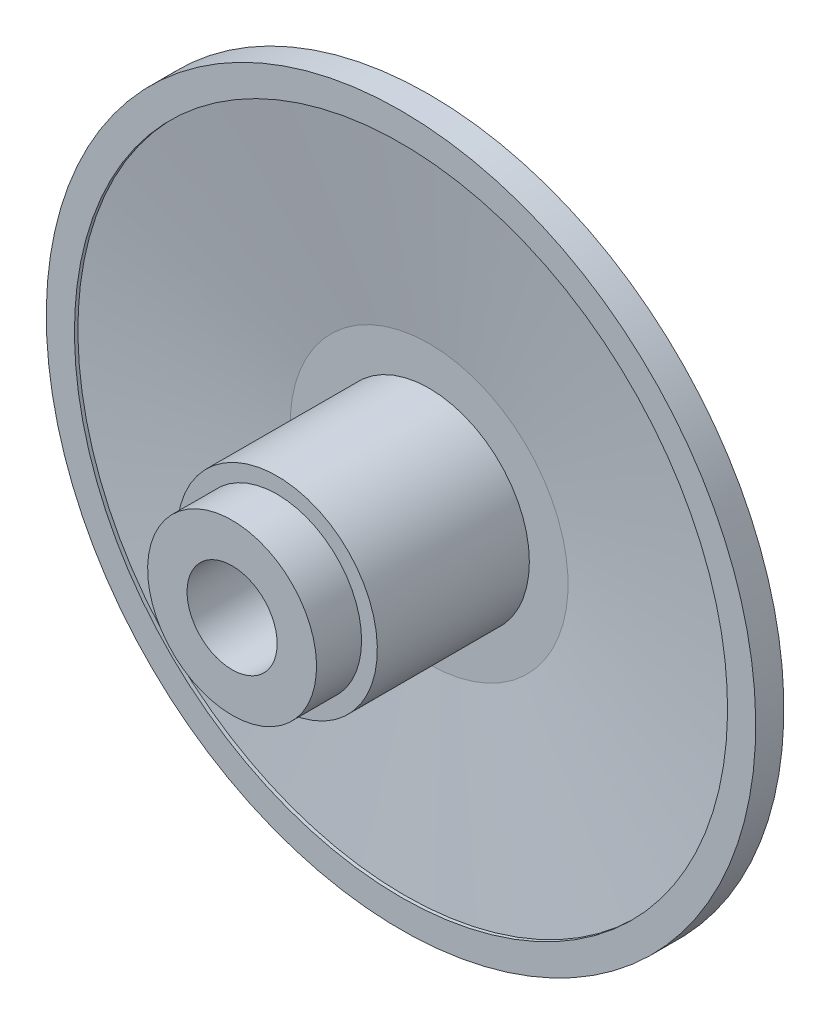
ISO-10303-21;
HEADER;
FILE_DESCRIPTION(('STEP AP214'),'2;1');
FILE_NAME('part.step','',(''),(''),'','','');
FILE_SCHEMA(('AUTOMOTIVE_DESIGN { 1 0 10303 214 1 1 1 1 }'));
ENDSEC;
DATA;
#1=APPLICATION_CONTEXT('core data for automotive mechanical design processes');
#2=APPLICATION_PROTOCOL_DEFINITION('international standard','automotive_design',2000,#1);
#3=PRODUCT_CONTEXT('',#1,'mechanical');
#4=PRODUCT('Part','Part','',(#3));
#5=PRODUCT_RELATED_PRODUCT_CATEGORY('part','',(#4));
#6=PRODUCT_DEFINITION_FORMATION('','',#4);
#7=PRODUCT_DEFINITION_CONTEXT('part definition',#1,'design');
#8=PRODUCT_DEFINITION('design','',#6,#7);
#9=PRODUCT_DEFINITION_SHAPE('','',#8);
#10=(LENGTH_UNIT() NAMED_UNIT(*) SI_UNIT(.MILLI.,.METRE.));
#11=(NAMED_UNIT(*) PLANE_ANGLE_UNIT() SI_UNIT($,.RADIAN.));
#12=(NAMED_UNIT(*) SI_UNIT($,.STERADIAN.) SOLID_ANGLE_UNIT());
#13=UNCERTAINTY_MEASURE_WITH_UNIT(LENGTH_MEASURE(1.E-05),#10,'distance_accuracy_value','');
#14=(GEOMETRIC_REPRESENTATION_CONTEXT(3) GLOBAL_UNCERTAINTY_ASSIGNED_CONTEXT((#13)) GLOBAL_UNIT_ASSIGNED_CONTEXT((#10,
#11,#12)) REPRESENTATION_CONTEXT('',''));
#15=CARTESIAN_POINT('',(0.,0.,0.));
#16=DIRECTION('',(0.,0.,1.));
#17=DIRECTION('',(1.,0.,0.));
#18=AXIS2_PLACEMENT_3D('',#15,#16,#17);
#19=CARTESIAN_POINT('',(0.,0.,0.));
#20=DIRECTION('',(0.,0.,-1.));
#21=DIRECTION('',(0.,1.,0.));
#22=AXIS2_PLACEMENT_3D('',#19,#20,#21);
#23=CYLINDRICAL_SURFACE('',#22,4.);
#24=CARTESIAN_POINT('',(0.,0.,0.));
#25=DIRECTION('',(0.,0.,1.));
#26=DIRECTION('',(0.,-1.,0.));
#27=AXIS2_PLACEMENT_3D('',#24,#25,#26);
#28=CIRCLE('',#27,4.);
#29=CARTESIAN_POINT('',(0.,-4.,0.));
#30=VERTEX_POINT('',#29);
#31=EDGE_CURVE('E11',#30,#30,#28,.T.);
#32=ORIENTED_EDGE('',*,*,#31,.T.);
#33=EDGE_LOOP('',(#32));
#34=FACE_BOUND('',#33,.T.);
#35=CARTESIAN_POINT('',(0.,0.,-20.));
#36=DIRECTION('',(0.,0.,1.));
#37=DIRECTION('',(0.,-1.,0.));
#38=AXIS2_PLACEMENT_3D('',#35,#36,#37);
#39=CIRCLE('',#38,4.);
#40=CARTESIAN_POINT('',(0.,4.,-20.));
#41=VERTEX_POINT('',#40);
#42=EDGE_CURVE('E95',#41,#41,#39,.T.);
#43=ORIENTED_EDGE('',*,*,#42,.F.);
#44=EDGE_LOOP('',(#43));
#45=FACE_BOUND('',#44,.T.);
#46=ADVANCED_FACE('F16',(#34,#45),#23,.F.);
#47=CARTESIAN_POINT('',(0.,0.,-4.));
#48=DIRECTION('',(0.,0.,1.));
#49=DIRECTION('',(0.,-1.,0.));
#50=AXIS2_PLACEMENT_3D('',#47,#48,#49);
#51=CYLINDRICAL_SURFACE('',#50,7.5);
#52=CARTESIAN_POINT('',(0.,0.,-4.));
#53=DIRECTION('',(0.,0.,1.));
#54=DIRECTION('',(0.,-1.,0.));
#55=AXIS2_PLACEMENT_3D('',#52,#53,#54);
#56=CIRCLE('',#55,7.5);
#57=CARTESIAN_POINT('',(0.,7.5,-4.));
#58=VERTEX_POINT('',#57);
#59=EDGE_CURVE('E20',#58,#58,#56,.T.);
#60=ORIENTED_EDGE('',*,*,#59,.T.);
#61=EDGE_LOOP('',(#60));
#62=FACE_BOUND('',#61,.T.);
#63=CARTESIAN_POINT('',(0.,0.,0.));
#64=DIRECTION('',(0.,0.,1.));
#65=DIRECTION('',(0.,-1.,0.));
#66=AXIS2_PLACEMENT_3D('',#63,#64,#65);
#67=CIRCLE('',#66,7.5);
#68=CARTESIAN_POINT('',(0.,-7.5,0.));
#69=VERTEX_POINT('',#68);
#70=EDGE_CURVE('E101',#69,#69,#67,.T.);
#71=ORIENTED_EDGE('',*,*,#70,.F.);
#72=EDGE_LOOP('',(#71));
#73=FACE_BOUND('',#72,.T.);
#74=ADVANCED_FACE('F142',(#62,#73),#51,.T.);
#75=CARTESIAN_POINT('',(0.,0.,-15.0213642611436));
#76=DIRECTION('',(0.,0.,1.));
#77=DIRECTION('',(0.,-1.,0.));
#78=AXIS2_PLACEMENT_3D('',#75,#76,#77);
#79=CONICAL_SURFACE('',#78,31.1738637185715,1.43996893072084);
#80=CARTESIAN_POINT('',(0.,0.,-17.5));
#81=DIRECTION('',(0.,0.,-1.));
#82=DIRECTION('',(0.,-1.,0.));
#83=AXIS2_PLACEMENT_3D('',#80,#81,#82);
#84=CIRCLE('',#83,12.3362321032632);
#85=CARTESIAN_POINT('',(0.,12.3362321032632,-17.5));
#86=VERTEX_POINT('',#85);
#87=EDGE_CURVE('E118',#86,#86,#84,.T.);
#88=ORIENTED_EDGE('',*,*,#87,.T.);
#89=EDGE_LOOP('',(#88));
#90=FACE_BOUND('',#89,.T.);
#91=CARTESIAN_POINT('',(0.,0.,-15.3073989609557));
#92=DIRECTION('',(0.,0.,-1.));
#93=DIRECTION('',(0.,-1.,0.));
#94=AXIS2_PLACEMENT_3D('',#91,#92,#93);
#95=CIRCLE('',#94,29.);
#96=CARTESIAN_POINT('',(0.,-29.,-15.3073989609557));
#97=VERTEX_POINT('',#96);
#98=EDGE_CURVE('E87',#97,#97,#95,.T.);
#99=ORIENTED_EDGE('',*,*,#98,.F.);
#100=EDGE_LOOP('',(#99));
#101=FACE_BOUND('',#100,.T.);
#102=ADVANCED_FACE('F148',(#90,#101),#79,.F.);
#103=CARTESIAN_POINT('',(0.,0.,-15.));
#104=DIRECTION('',(0.,0.,-1.));
#105=DIRECTION('',(0.,1.,0.));
#106=AXIS2_PLACEMENT_3D('',#103,#104,#105);
#107=CYLINDRICAL_SURFACE('',#106,29.);
#108=CARTESIAN_POINT('',(0.,0.,-15.));
#109=DIRECTION('',(0.,0.,1.));
#110=DIRECTION('',(0.,-1.,0.));
#111=AXIS2_PLACEMENT_3D('',#108,#109,#110);
#112=CIRCLE('',#111,29.);
#113=CARTESIAN_POINT('',(0.,-29.,-15.));
#114=VERTEX_POINT('',#113);
#115=EDGE_CURVE('E117',#114,#114,#112,.T.);
#116=ORIENTED_EDGE('',*,*,#115,.T.);
#117=EDGE_LOOP('',(#116));
#118=FACE_BOUND('',#117,.T.);
#119=ORIENTED_EDGE('',*,*,#98,.T.);
#120=EDGE_LOOP('',(#119));
#121=FACE_BOUND('',#120,.T.);
#122=ADVANCED_FACE('F127',(#118,#121),#107,.F.);
#123=CARTESIAN_POINT('',(0.,0.,-17.5));
#124=DIRECTION('',(0.,0.,1.));
#125=DIRECTION('',(0.,-1.,0.));
#126=AXIS2_PLACEMENT_3D('',#123,#124,#125);
#127=CONICAL_SURFACE('',#126,31.5,1.43996893072084);
#128=CARTESIAN_POINT('',(0.,0.,-20.));
#129=DIRECTION('',(0.,0.,-1.));
#130=DIRECTION('',(0.,1.,0.));
#131=AXIS2_PLACEMENT_3D('',#128,#129,#130);
#132=CIRCLE('',#131,12.5);
#133=CARTESIAN_POINT('',(0.,-12.5,-20.));
#134=VERTEX_POINT('',#133);
#135=EDGE_CURVE('E91',#134,#134,#132,.T.);
#136=ORIENTED_EDGE('',*,*,#135,.F.);
#137=EDGE_LOOP('',(#136));
#138=FACE_BOUND('',#137,.T.);
#139=CARTESIAN_POINT('',(0.,0.,-17.5));
#140=DIRECTION('',(0.,0.,-1.));
#141=DIRECTION('',(0.,1.,0.));
#142=AXIS2_PLACEMENT_3D('',#139,#140,#141);
#143=CIRCLE('',#142,31.5);
#144=CARTESIAN_POINT('',(0.,-31.5,-17.5));
#145=VERTEX_POINT('',#144);
#146=EDGE_CURVE('E78',#145,#145,#143,.T.);
#147=ORIENTED_EDGE('',*,*,#146,.T.);
#148=EDGE_LOOP('',(#147));
#149=FACE_BOUND('',#148,.T.);
#150=ADVANCED_FACE('F162',(#138,#149),#127,.T.);
#151=CARTESIAN_POINT('',(0.,0.,-15.));
#152=DIRECTION('',(0.,0.,-1.));
#153=DIRECTION('',(0.,1.,0.));
#154=AXIS2_PLACEMENT_3D('',#151,#152,#153);
#155=CYLINDRICAL_SURFACE('',#154,31.5);
#156=CARTESIAN_POINT('',(0.,0.,-15.));
#157=DIRECTION('',(0.,0.,1.));
#158=DIRECTION('',(0.,-1.,0.));
#159=AXIS2_PLACEMENT_3D('',#156,#157,#158);
#160=CIRCLE('',#159,31.5);
#161=CARTESIAN_POINT('',(0.,31.5,-15.));
#162=VERTEX_POINT('',#161);
#163=EDGE_CURVE('E98',#162,#162,#160,.T.);
#164=ORIENTED_EDGE('',*,*,#163,.F.);
#165=EDGE_LOOP('',(#164));
#166=FACE_BOUND('',#165,.T.);
#167=ORIENTED_EDGE('',*,*,#146,.F.);
#168=EDGE_LOOP('',(#167));
#169=FACE_BOUND('',#168,.T.);
#170=ADVANCED_FACE('F159',(#166,#169),#155,.T.);
#171=CARTESIAN_POINT('',(0.,0.,-42.6730014102411));
#172=DIRECTION('',(0.,0.,1.));
#173=DIRECTION('',(0.,-1.,0.));
#174=AXIS2_PLACEMENT_3D('',#171,#172,#173);
#175=CYLINDRICAL_SURFACE('',#174,8.9);
#176=CARTESIAN_POINT('',(0.,0.,-17.5));
#177=DIRECTION('',(0.,0.,1.));
#178=DIRECTION('',(0.,-1.,0.));
#179=AXIS2_PLACEMENT_3D('',#176,#177,#178);
#180=CIRCLE('',#179,8.9);
#181=CARTESIAN_POINT('',(0.,8.9,-17.5));
#182=VERTEX_POINT('',#181);
#183=EDGE_CURVE('E74',#182,#182,#180,.T.);
#184=ORIENTED_EDGE('',*,*,#183,.T.);
#185=EDGE_LOOP('',(#184));
#186=FACE_BOUND('',#185,.T.);
#187=CARTESIAN_POINT('',(0.,0.,-4.));
#188=DIRECTION('',(0.,0.,-1.));
#189=DIRECTION('',(0.,-1.,0.));
#190=AXIS2_PLACEMENT_3D('',#187,#188,#189);
#191=CIRCLE('',#190,8.9);
#192=CARTESIAN_POINT('',(0.,-8.9,-4.));
#193=VERTEX_POINT('',#192);
#194=EDGE_CURVE('E79',#193,#193,#191,.T.);
#195=ORIENTED_EDGE('',*,*,#194,.T.);
#196=EDGE_LOOP('',(#195));
#197=FACE_BOUND('',#196,.T.);
#198=ADVANCED_FACE('F156',(#186,#197),#175,.T.);
#199=CARTESIAN_POINT('',(0.,0.,-20.));
#200=DIRECTION('',(0.,0.,1.));
#201=DIRECTION('',(1.,0.,0.));
#202=AXIS2_PLACEMENT_3D('',#199,#200,#201);
#203=PLANE('',#202);
#204=ORIENTED_EDGE('',*,*,#135,.T.);
#205=EDGE_LOOP('',(#204));
#206=FACE_BOUND('',#205,.T.);
#207=ORIENTED_EDGE('',*,*,#42,.T.);
#208=EDGE_LOOP('',(#207));
#209=FACE_BOUND('',#208,.T.);
#210=ADVANCED_FACE('F139',(#206,#209),#203,.F.);
#211=CARTESIAN_POINT('',(0.,0.,0.));
#212=DIRECTION('',(0.,0.,1.));
#213=DIRECTION('',(1.,0.,0.));
#214=AXIS2_PLACEMENT_3D('',#211,#212,#213);
#215=PLANE('',#214);
#216=ORIENTED_EDGE('',*,*,#70,.T.);
#217=EDGE_LOOP('',(#216));
#218=FACE_BOUND('',#217,.T.);
#219=ORIENTED_EDGE('',*,*,#31,.F.);
#220=EDGE_LOOP('',(#219));
#221=FACE_BOUND('',#220,.T.);
#222=ADVANCED_FACE('F131',(#218,#221),#215,.T.);
#223=CARTESIAN_POINT('',(0.,0.,-15.));
#224=DIRECTION('',(0.,0.,1.));
#225=DIRECTION('',(1.,0.,0.));
#226=AXIS2_PLACEMENT_3D('',#223,#224,#225);
#227=PLANE('',#226);
#228=ORIENTED_EDGE('',*,*,#163,.T.);
#229=EDGE_LOOP('',(#228));
#230=FACE_BOUND('',#229,.T.);
#231=ORIENTED_EDGE('',*,*,#115,.F.);
#232=EDGE_LOOP('',(#231));
#233=FACE_BOUND('',#232,.T.);
#234=ADVANCED_FACE('F18',(#230,#233),#227,.T.);
#235=CARTESIAN_POINT('',(0.,0.,-17.5));
#236=DIRECTION('',(0.,0.,1.));
#237=DIRECTION('',(1.,0.,0.));
#238=AXIS2_PLACEMENT_3D('',#235,#236,#237);
#239=PLANE('',#238);
#240=ORIENTED_EDGE('',*,*,#87,.F.);
#241=EDGE_LOOP('',(#240));
#242=FACE_BOUND('',#241,.T.);
#243=ORIENTED_EDGE('',*,*,#183,.F.);
#244=EDGE_LOOP('',(#243));
#245=FACE_BOUND('',#244,.T.);
#246=ADVANCED_FACE('F75',(#242,#245),#239,.T.);
#247=CARTESIAN_POINT('',(0.,0.,-4.));
#248=DIRECTION('',(0.,0.,1.));
#249=DIRECTION('',(1.,0.,0.));
#250=AXIS2_PLACEMENT_3D('',#247,#248,#249);
#251=PLANE('',#250);
#252=ORIENTED_EDGE('',*,*,#194,.F.);
#253=EDGE_LOOP('',(#252));
#254=FACE_BOUND('',#253,.T.);
#255=ORIENTED_EDGE('',*,*,#59,.F.);
#256=EDGE_LOOP('',(#255));
#257=FACE_BOUND('',#256,.T.);
#258=ADVANCED_FACE('F137',(#254,#257),#251,.T.);
#259=CLOSED_SHELL('',(#46,#74,#102,#122,#150,#170,#198,#210,#222,#234,#246,#258));
#260=MANIFOLD_SOLID_BREP('B1',#259);
#261=ADVANCED_BREP_SHAPE_REPRESENTATION('',(#18,#260),#14);
#262=SHAPE_DEFINITION_REPRESENTATION(#9,#261);
ENDSEC;
END-ISO-10303-21;
